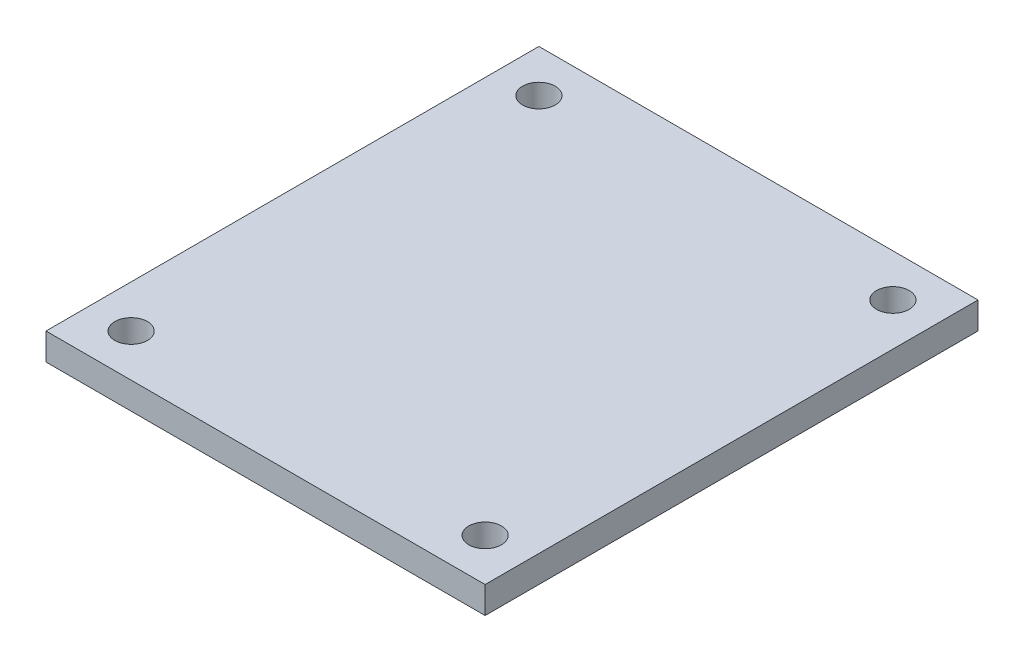
ISO-10303-21;
HEADER;
FILE_DESCRIPTION(('STEP AP214'),'2;1');
FILE_NAME('part.step','',(''),(''),'','','');
FILE_SCHEMA(('AUTOMOTIVE_DESIGN { 1 0 10303 214 1 1 1 1 }'));
ENDSEC;
DATA;
#1=APPLICATION_CONTEXT('core data for automotive mechanical design processes');
#2=APPLICATION_PROTOCOL_DEFINITION('international standard','automotive_design',2000,#1);
#3=PRODUCT_CONTEXT('',#1,'mechanical');
#4=PRODUCT('Part','Part','',(#3));
#5=PRODUCT_RELATED_PRODUCT_CATEGORY('part','',(#4));
#6=PRODUCT_DEFINITION_FORMATION('','',#4);
#7=PRODUCT_DEFINITION_CONTEXT('part definition',#1,'design');
#8=PRODUCT_DEFINITION('design','',#6,#7);
#9=PRODUCT_DEFINITION_SHAPE('','',#8);
#10=(LENGTH_UNIT() NAMED_UNIT(*) SI_UNIT(.MILLI.,.METRE.));
#11=(NAMED_UNIT(*) PLANE_ANGLE_UNIT() SI_UNIT($,.RADIAN.));
#12=(NAMED_UNIT(*) SI_UNIT($,.STERADIAN.) SOLID_ANGLE_UNIT());
#13=UNCERTAINTY_MEASURE_WITH_UNIT(LENGTH_MEASURE(1.E-05),#10,'distance_accuracy_value','');
#14=(GEOMETRIC_REPRESENTATION_CONTEXT(3) GLOBAL_UNCERTAINTY_ASSIGNED_CONTEXT((#13)) GLOBAL_UNIT_ASSIGNED_CONTEXT((#10,
#11,#12)) REPRESENTATION_CONTEXT('',''));
#15=CARTESIAN_POINT('',(0.,0.,0.));
#16=DIRECTION('',(0.,0.,1.));
#17=DIRECTION('',(1.,0.,0.));
#18=AXIS2_PLACEMENT_3D('',#15,#16,#17);
#19=CARTESIAN_POINT('',(0.,6.,0.));
#20=DIRECTION('',(1.,0.,0.));
#21=DIRECTION('',(0.,0.,-1.));
#22=AXIS2_PLACEMENT_3D('',#19,#20,#21);
#23=PLANE('',#22);
#24=DIRECTION('',(0.,0.,1.));
#25=VECTOR('',#24,1.);
#26=CARTESIAN_POINT('',(0.,0.,0.));
#27=LINE('',#26,#25);
#28=CARTESIAN_POINT('',(0.,0.,-110.));
#29=VERTEX_POINT('',#28);
#30=CARTESIAN_POINT('',(0.,0.,0.));
#31=VERTEX_POINT('',#30);
#32=EDGE_CURVE('E96',#29,#31,#27,.T.);
#33=ORIENTED_EDGE('',*,*,#32,.T.);
#34=DIRECTION('',(0.,-1.,0.));
#35=VECTOR('',#34,1.);
#36=CARTESIAN_POINT('',(0.,6.,0.));
#37=LINE('',#36,#35);
#38=CARTESIAN_POINT('',(0.,6.,0.));
#39=VERTEX_POINT('',#38);
#40=EDGE_CURVE('E11',#39,#31,#37,.T.);
#41=ORIENTED_EDGE('',*,*,#40,.F.);
#42=DIRECTION('',(0.,0.,1.));
#43=VECTOR('',#42,1.);
#44=CARTESIAN_POINT('',(0.,6.,0.));
#45=LINE('',#44,#43);
#46=CARTESIAN_POINT('',(0.,6.,-110.));
#47=VERTEX_POINT('',#46);
#48=EDGE_CURVE('E84',#47,#39,#45,.T.);
#49=ORIENTED_EDGE('',*,*,#48,.F.);
#50=DIRECTION('',(0.,-1.,0.));
#51=VECTOR('',#50,1.);
#52=CARTESIAN_POINT('',(0.,6.,-110.));
#53=LINE('',#52,#51);
#54=EDGE_CURVE('E92',#47,#29,#53,.T.);
#55=ORIENTED_EDGE('',*,*,#54,.T.);
#56=EDGE_LOOP('',(#33,#41,#49,#55));
#57=FACE_BOUND('',#56,.T.);
#58=ADVANCED_FACE('F33',(#57),#23,.F.);
#59=CARTESIAN_POINT('',(0.,6.,0.));
#60=DIRECTION('',(0.,0.,-1.));
#61=DIRECTION('',(-1.,0.,0.));
#62=AXIS2_PLACEMENT_3D('',#59,#60,#61);
#63=PLANE('',#62);
#64=DIRECTION('',(1.,0.,0.));
#65=VECTOR('',#64,1.);
#66=CARTESIAN_POINT('',(0.,0.,0.));
#67=LINE('',#66,#65);
#68=CARTESIAN_POINT('',(98.,0.,0.));
#69=VERTEX_POINT('',#68);
#70=EDGE_CURVE('E88',#31,#69,#67,.T.);
#71=ORIENTED_EDGE('',*,*,#70,.T.);
#72=DIRECTION('',(0.,-1.,0.));
#73=VECTOR('',#72,1.);
#74=CARTESIAN_POINT('',(98.,6.,0.));
#75=LINE('',#74,#73);
#76=CARTESIAN_POINT('',(98.,6.,0.));
#77=VERTEX_POINT('',#76);
#78=EDGE_CURVE('E41',#77,#69,#75,.T.);
#79=ORIENTED_EDGE('',*,*,#78,.F.);
#80=DIRECTION('',(1.,0.,0.));
#81=VECTOR('',#80,1.);
#82=CARTESIAN_POINT('',(0.,6.,0.));
#83=LINE('',#82,#81);
#84=EDGE_CURVE('E79',#39,#77,#83,.T.);
#85=ORIENTED_EDGE('',*,*,#84,.F.);
#86=ORIENTED_EDGE('',*,*,#40,.T.);
#87=EDGE_LOOP('',(#71,#79,#85,#86));
#88=FACE_BOUND('',#87,.T.);
#89=ADVANCED_FACE('F87',(#88),#63,.F.);
#90=CARTESIAN_POINT('',(98.,6.,0.));
#91=DIRECTION('',(-1.,0.,0.));
#92=DIRECTION('',(0.,0.,1.));
#93=AXIS2_PLACEMENT_3D('',#90,#91,#92);
#94=PLANE('',#93);
#95=DIRECTION('',(0.,0.,-1.));
#96=VECTOR('',#95,1.);
#97=CARTESIAN_POINT('',(98.,0.,0.));
#98=LINE('',#97,#96);
#99=CARTESIAN_POINT('',(98.,0.,-110.));
#100=VERTEX_POINT('',#99);
#101=EDGE_CURVE('E66',#69,#100,#98,.T.);
#102=ORIENTED_EDGE('',*,*,#101,.T.);
#103=DIRECTION('',(0.,-1.,0.));
#104=VECTOR('',#103,1.);
#105=CARTESIAN_POINT('',(98.,6.,-110.));
#106=LINE('',#105,#104);
#107=CARTESIAN_POINT('',(98.,6.,-110.));
#108=VERTEX_POINT('',#107);
#109=EDGE_CURVE('E89',#108,#100,#106,.T.);
#110=ORIENTED_EDGE('',*,*,#109,.F.);
#111=DIRECTION('',(0.,0.,-1.));
#112=VECTOR('',#111,1.);
#113=CARTESIAN_POINT('',(98.,6.,0.));
#114=LINE('',#113,#112);
#115=EDGE_CURVE('E82',#77,#108,#114,.T.);
#116=ORIENTED_EDGE('',*,*,#115,.F.);
#117=ORIENTED_EDGE('',*,*,#78,.T.);
#118=EDGE_LOOP('',(#102,#110,#116,#117));
#119=FACE_BOUND('',#118,.T.);
#120=ADVANCED_FACE('F90',(#119),#94,.F.);
#121=CARTESIAN_POINT('',(0.,6.,-110.));
#122=DIRECTION('',(0.,0.,1.));
#123=DIRECTION('',(1.,0.,0.));
#124=AXIS2_PLACEMENT_3D('',#121,#122,#123);
#125=PLANE('',#124);
#126=DIRECTION('',(-1.,0.,0.));
#127=VECTOR('',#126,1.);
#128=CARTESIAN_POINT('',(0.,0.,-110.));
#129=LINE('',#128,#127);
#130=EDGE_CURVE('E72',#100,#29,#129,.T.);
#131=ORIENTED_EDGE('',*,*,#130,.T.);
#132=ORIENTED_EDGE('',*,*,#54,.F.);
#133=DIRECTION('',(-1.,0.,0.));
#134=VECTOR('',#133,1.);
#135=CARTESIAN_POINT('',(0.,6.,-110.));
#136=LINE('',#135,#134);
#137=EDGE_CURVE('E49',#108,#47,#136,.T.);
#138=ORIENTED_EDGE('',*,*,#137,.F.);
#139=ORIENTED_EDGE('',*,*,#109,.T.);
#140=EDGE_LOOP('',(#131,#132,#138,#139));
#141=FACE_BOUND('',#140,.T.);
#142=ADVANCED_FACE('F104',(#141),#125,.F.);
#143=CARTESIAN_POINT('',(0.,6.,0.));
#144=DIRECTION('',(0.,-1.,0.));
#145=DIRECTION('',(0.,0.,-1.));
#146=AXIS2_PLACEMENT_3D('',#143,#144,#145);
#147=PLANE('',#146);
#148=CARTESIAN_POINT('',(9.49999999999999,6.,-9.49999999999999));
#149=DIRECTION('',(0.,1.,0.));
#150=DIRECTION('',(0.,0.,-1.));
#151=AXIS2_PLACEMENT_3D('',#148,#149,#150);
#152=CIRCLE('',#151,3.65);
#153=CARTESIAN_POINT('',(9.49999999999999,6.,-13.15));
#154=VERTEX_POINT('',#153);
#155=EDGE_CURVE('E116',#154,#154,#152,.T.);
#156=ORIENTED_EDGE('',*,*,#155,.F.);
#157=EDGE_LOOP('',(#156));
#158=FACE_BOUND('',#157,.T.);
#159=CARTESIAN_POINT('',(88.5,6.,-9.49999999999998));
#160=DIRECTION('',(0.,1.,0.));
#161=DIRECTION('',(0.,0.,-1.));
#162=AXIS2_PLACEMENT_3D('',#159,#160,#161);
#163=CIRCLE('',#162,3.65);
#164=CARTESIAN_POINT('',(88.5,6.,-13.15));
#165=VERTEX_POINT('',#164);
#166=EDGE_CURVE('E122',#165,#165,#163,.T.);
#167=ORIENTED_EDGE('',*,*,#166,.F.);
#168=EDGE_LOOP('',(#167));
#169=FACE_BOUND('',#168,.T.);
#170=CARTESIAN_POINT('',(88.5,6.,-100.5));
#171=DIRECTION('',(0.,1.,0.));
#172=DIRECTION('',(0.,0.,1.));
#173=AXIS2_PLACEMENT_3D('',#170,#171,#172);
#174=CIRCLE('',#173,3.65);
#175=CARTESIAN_POINT('',(88.5,6.,-96.85));
#176=VERTEX_POINT('',#175);
#177=EDGE_CURVE('E128',#176,#176,#174,.T.);
#178=ORIENTED_EDGE('',*,*,#177,.F.);
#179=EDGE_LOOP('',(#178));
#180=FACE_BOUND('',#179,.T.);
#181=CARTESIAN_POINT('',(9.49999999999999,6.,-100.5));
#182=DIRECTION('',(0.,1.,0.));
#183=DIRECTION('',(0.,0.,1.));
#184=AXIS2_PLACEMENT_3D('',#181,#182,#183);
#185=CIRCLE('',#184,3.65);
#186=CARTESIAN_POINT('',(9.49999999999999,6.,-96.85));
#187=VERTEX_POINT('',#186);
#188=EDGE_CURVE('E110',#187,#187,#185,.T.);
#189=ORIENTED_EDGE('',*,*,#188,.F.);
#190=EDGE_LOOP('',(#189));
#191=FACE_BOUND('',#190,.T.);
#192=ORIENTED_EDGE('',*,*,#48,.T.);
#193=ORIENTED_EDGE('',*,*,#84,.T.);
#194=ORIENTED_EDGE('',*,*,#115,.T.);
#195=ORIENTED_EDGE('',*,*,#137,.T.);
#196=EDGE_LOOP('',(#192,#193,#194,#195));
#197=FACE_BOUND('',#196,.T.);
#198=ADVANCED_FACE('F80',(#158,#169,#180,#191,#197),#147,.F.);
#199=CARTESIAN_POINT('',(0.,0.,0.));
#200=DIRECTION('',(0.,-1.,0.));
#201=DIRECTION('',(0.,0.,-1.));
#202=AXIS2_PLACEMENT_3D('',#199,#200,#201);
#203=PLANE('',#202);
#204=CARTESIAN_POINT('',(9.49999999999999,0.,-9.49999999999999));
#205=DIRECTION('',(0.,1.,0.));
#206=DIRECTION('',(0.,0.,-1.));
#207=AXIS2_PLACEMENT_3D('',#204,#205,#206);
#208=CIRCLE('',#207,3.65);
#209=CARTESIAN_POINT('',(9.49999999999999,0.,-13.15));
#210=VERTEX_POINT('',#209);
#211=EDGE_CURVE('E119',#210,#210,#208,.T.);
#212=ORIENTED_EDGE('',*,*,#211,.T.);
#213=EDGE_LOOP('',(#212));
#214=FACE_BOUND('',#213,.T.);
#215=CARTESIAN_POINT('',(88.5,0.,-9.49999999999998));
#216=DIRECTION('',(0.,1.,0.));
#217=DIRECTION('',(0.,0.,-1.));
#218=AXIS2_PLACEMENT_3D('',#215,#216,#217);
#219=CIRCLE('',#218,3.65);
#220=CARTESIAN_POINT('',(88.5,0.,-13.15));
#221=VERTEX_POINT('',#220);
#222=EDGE_CURVE('E125',#221,#221,#219,.T.);
#223=ORIENTED_EDGE('',*,*,#222,.T.);
#224=EDGE_LOOP('',(#223));
#225=FACE_BOUND('',#224,.T.);
#226=CARTESIAN_POINT('',(88.5,0.,-100.5));
#227=DIRECTION('',(0.,1.,0.));
#228=DIRECTION('',(0.,0.,1.));
#229=AXIS2_PLACEMENT_3D('',#226,#227,#228);
#230=CIRCLE('',#229,3.65);
#231=CARTESIAN_POINT('',(88.5,0.,-96.85));
#232=VERTEX_POINT('',#231);
#233=EDGE_CURVE('E113',#232,#232,#230,.T.);
#234=ORIENTED_EDGE('',*,*,#233,.T.);
#235=EDGE_LOOP('',(#234));
#236=FACE_BOUND('',#235,.T.);
#237=CARTESIAN_POINT('',(9.49999999999999,0.,-100.5));
#238=DIRECTION('',(0.,1.,0.));
#239=DIRECTION('',(0.,0.,1.));
#240=AXIS2_PLACEMENT_3D('',#237,#238,#239);
#241=CIRCLE('',#240,3.65);
#242=CARTESIAN_POINT('',(9.49999999999999,0.,-96.85));
#243=VERTEX_POINT('',#242);
#244=EDGE_CURVE('E99',#243,#243,#241,.T.);
#245=ORIENTED_EDGE('',*,*,#244,.T.);
#246=EDGE_LOOP('',(#245));
#247=FACE_BOUND('',#246,.T.);
#248=ORIENTED_EDGE('',*,*,#32,.F.);
#249=ORIENTED_EDGE('',*,*,#130,.F.);
#250=ORIENTED_EDGE('',*,*,#101,.F.);
#251=ORIENTED_EDGE('',*,*,#70,.F.);
#252=EDGE_LOOP('',(#248,#249,#250,#251));
#253=FACE_BOUND('',#252,.T.);
#254=ADVANCED_FACE('F107',(#214,#225,#236,#247,#253),#203,.T.);
#255=CARTESIAN_POINT('',(9.49999999999999,0.,-100.5));
#256=DIRECTION('',(0.,1.,0.));
#257=DIRECTION('',(0.,0.,1.));
#258=AXIS2_PLACEMENT_3D('',#255,#256,#257);
#259=CYLINDRICAL_SURFACE('',#258,3.65);
#260=ORIENTED_EDGE('',*,*,#244,.F.);
#261=EDGE_LOOP('',(#260));
#262=FACE_BOUND('',#261,.T.);
#263=ORIENTED_EDGE('',*,*,#188,.T.);
#264=EDGE_LOOP('',(#263));
#265=FACE_BOUND('',#264,.T.);
#266=ADVANCED_FACE('F140',(#262,#265),#259,.F.);
#267=CARTESIAN_POINT('',(88.5,0.,-100.5));
#268=DIRECTION('',(0.,1.,0.));
#269=DIRECTION('',(0.,0.,1.));
#270=AXIS2_PLACEMENT_3D('',#267,#268,#269);
#271=CYLINDRICAL_SURFACE('',#270,3.65);
#272=ORIENTED_EDGE('',*,*,#233,.F.);
#273=EDGE_LOOP('',(#272));
#274=FACE_BOUND('',#273,.T.);
#275=ORIENTED_EDGE('',*,*,#177,.T.);
#276=EDGE_LOOP('',(#275));
#277=FACE_BOUND('',#276,.T.);
#278=ADVANCED_FACE('F136',(#274,#277),#271,.F.);
#279=CARTESIAN_POINT('',(88.5,0.,-9.49999999999998));
#280=DIRECTION('',(0.,1.,0.));
#281=DIRECTION('',(0.,0.,1.));
#282=AXIS2_PLACEMENT_3D('',#279,#280,#281);
#283=CYLINDRICAL_SURFACE('',#282,3.65);
#284=ORIENTED_EDGE('',*,*,#222,.F.);
#285=EDGE_LOOP('',(#284));
#286=FACE_BOUND('',#285,.T.);
#287=ORIENTED_EDGE('',*,*,#166,.T.);
#288=EDGE_LOOP('',(#287));
#289=FACE_BOUND('',#288,.T.);
#290=ADVANCED_FACE('F139',(#286,#289),#283,.F.);
#291=CARTESIAN_POINT('',(9.49999999999999,0.,-9.49999999999999));
#292=DIRECTION('',(0.,1.,0.));
#293=DIRECTION('',(0.,0.,1.));
#294=AXIS2_PLACEMENT_3D('',#291,#292,#293);
#295=CYLINDRICAL_SURFACE('',#294,3.65);
#296=ORIENTED_EDGE('',*,*,#211,.F.);
#297=EDGE_LOOP('',(#296));
#298=FACE_BOUND('',#297,.T.);
#299=ORIENTED_EDGE('',*,*,#155,.T.);
#300=EDGE_LOOP('',(#299));
#301=FACE_BOUND('',#300,.T.);
#302=ADVANCED_FACE('F201',(#298,#301),#295,.F.);
#303=CLOSED_SHELL('',(#58,#89,#120,#142,#198,#254,#266,#278,#290,#302));
#304=MANIFOLD_SOLID_BREP('B2',#303);
#305=ADVANCED_BREP_SHAPE_REPRESENTATION('',(#18,#304),#14);
#306=SHAPE_DEFINITION_REPRESENTATION(#9,#305);
ENDSEC;
END-ISO-10303-21;
